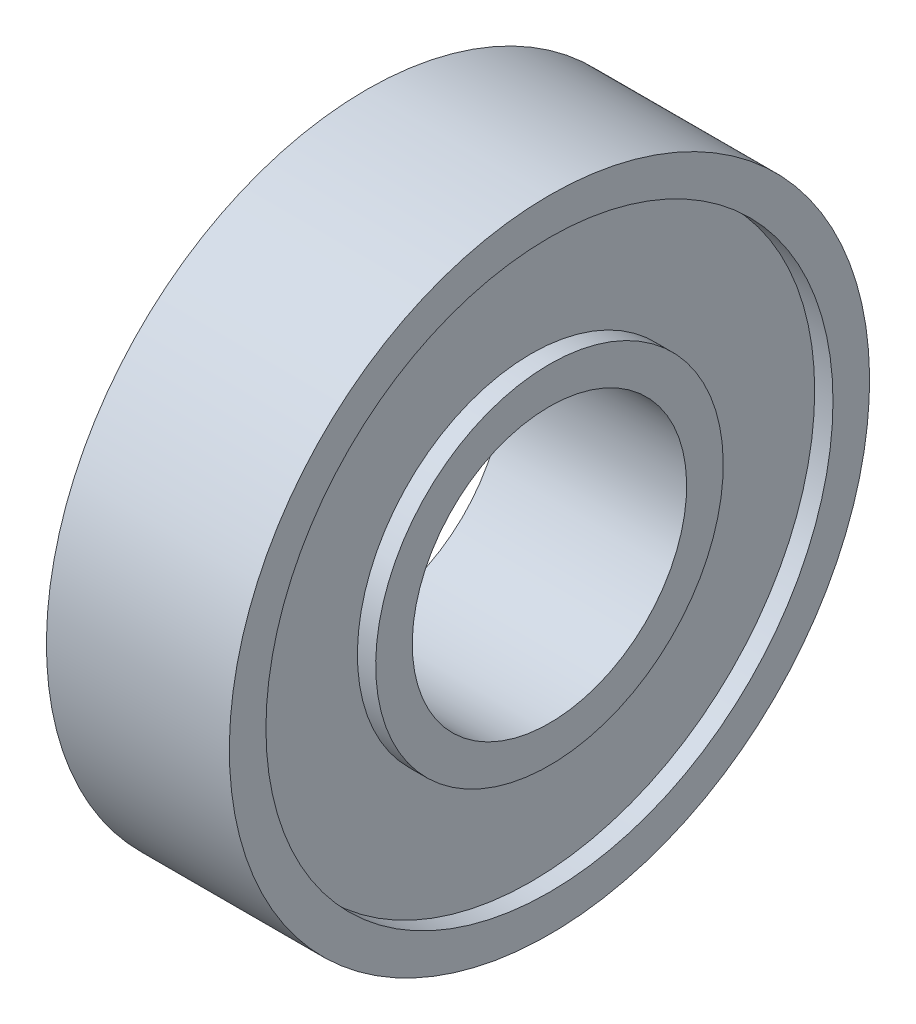
ISO-10303-21;
HEADER;
FILE_DESCRIPTION(('STEP AP214'),'2;1');
FILE_NAME('part.step','',(''),(''),'','','');
FILE_SCHEMA(('AUTOMOTIVE_DESIGN { 1 0 10303 214 1 1 1 1 }'));
ENDSEC;
DATA;
#1=APPLICATION_CONTEXT('core data for automotive mechanical design processes');
#2=APPLICATION_PROTOCOL_DEFINITION('international standard','automotive_design',2000,#1);
#3=PRODUCT_CONTEXT('',#1,'mechanical');
#4=PRODUCT('Part','Part','',(#3));
#5=PRODUCT_RELATED_PRODUCT_CATEGORY('part','',(#4));
#6=PRODUCT_DEFINITION_FORMATION('','',#4);
#7=PRODUCT_DEFINITION_CONTEXT('part definition',#1,'design');
#8=PRODUCT_DEFINITION('design','',#6,#7);
#9=PRODUCT_DEFINITION_SHAPE('','',#8);
#10=(LENGTH_UNIT() NAMED_UNIT(*) SI_UNIT(.MILLI.,.METRE.));
#11=(NAMED_UNIT(*) PLANE_ANGLE_UNIT() SI_UNIT($,.RADIAN.));
#12=(NAMED_UNIT(*) SI_UNIT($,.STERADIAN.) SOLID_ANGLE_UNIT());
#13=UNCERTAINTY_MEASURE_WITH_UNIT(LENGTH_MEASURE(1.E-05),#10,'distance_accuracy_value','');
#14=(GEOMETRIC_REPRESENTATION_CONTEXT(3) GLOBAL_UNCERTAINTY_ASSIGNED_CONTEXT((#13)) GLOBAL_UNIT_ASSIGNED_CONTEXT((#10,
#11,#12)) REPRESENTATION_CONTEXT('',''));
#15=CARTESIAN_POINT('',(0.,0.,0.));
#16=DIRECTION('',(0.,0.,1.));
#17=DIRECTION('',(1.,0.,0.));
#18=AXIS2_PLACEMENT_3D('',#15,#16,#17);
#19=CARTESIAN_POINT('',(-4.,12.4,0.));
#20=DIRECTION('',(-1.,0.,0.));
#21=DIRECTION('',(0.,-1.,0.));
#22=AXIS2_PLACEMENT_3D('',#19,#20,#21);
#23=PLANE('',#22);
#24=CARTESIAN_POINT('',(-4.,0.,0.));
#25=DIRECTION('',(1.,0.,0.));
#26=DIRECTION('',(0.,1.,0.));
#27=AXIS2_PLACEMENT_3D('',#24,#25,#26);
#28=CIRCLE('',#27,12.4);
#29=CARTESIAN_POINT('',(-4.,12.4,0.));
#30=VERTEX_POINT('',#29);
#31=EDGE_CURVE('E10',#30,#30,#28,.T.);
#32=ORIENTED_EDGE('',*,*,#31,.T.);
#33=EDGE_LOOP('',(#32));
#34=FACE_BOUND('',#33,.T.);
#35=CARTESIAN_POINT('',(-4.,0.,0.));
#36=DIRECTION('',(1.,0.,0.));
#37=DIRECTION('',(0.,1.,0.));
#38=AXIS2_PLACEMENT_3D('',#35,#36,#37);
#39=CIRCLE('',#38,14.);
#40=CARTESIAN_POINT('',(-4.,14.,0.));
#41=VERTEX_POINT('',#40);
#42=EDGE_CURVE('E70',#41,#41,#39,.T.);
#43=ORIENTED_EDGE('',*,*,#42,.F.);
#44=EDGE_LOOP('',(#43));
#45=FACE_BOUND('',#44,.T.);
#46=ADVANCED_FACE('F30',(#34,#45),#23,.T.);
#47=CARTESIAN_POINT('',(6.48120818860915,0.,0.));
#48=DIRECTION('',(1.,0.,0.));
#49=DIRECTION('',(0.,1.,0.));
#50=AXIS2_PLACEMENT_3D('',#47,#48,#49);
#51=CYLINDRICAL_SURFACE('',#50,12.4);
#52=CARTESIAN_POINT('',(-3.2,0.,0.));
#53=DIRECTION('',(1.,0.,0.));
#54=DIRECTION('',(0.,1.,0.));
#55=AXIS2_PLACEMENT_3D('',#52,#53,#54);
#56=CIRCLE('',#55,12.4);
#57=CARTESIAN_POINT('',(-3.2,12.4,0.));
#58=VERTEX_POINT('',#57);
#59=EDGE_CURVE('E36',#58,#58,#56,.T.);
#60=ORIENTED_EDGE('',*,*,#59,.T.);
#61=EDGE_LOOP('',(#60));
#62=FACE_BOUND('',#61,.T.);
#63=ORIENTED_EDGE('',*,*,#31,.F.);
#64=EDGE_LOOP('',(#63));
#65=FACE_BOUND('',#64,.T.);
#66=ADVANCED_FACE('F78',(#62,#65),#51,.F.);
#67=CARTESIAN_POINT('',(-3.2,7.6,0.));
#68=DIRECTION('',(-1.,0.,0.));
#69=DIRECTION('',(0.,-1.,0.));
#70=AXIS2_PLACEMENT_3D('',#67,#68,#69);
#71=PLANE('',#70);
#72=CARTESIAN_POINT('',(-3.2,0.,0.));
#73=DIRECTION('',(1.,0.,0.));
#74=DIRECTION('',(0.,1.,0.));
#75=AXIS2_PLACEMENT_3D('',#72,#73,#74);
#76=CIRCLE('',#75,7.6);
#77=CARTESIAN_POINT('',(-3.2,7.6,0.));
#78=VERTEX_POINT('',#77);
#79=EDGE_CURVE('E40',#78,#78,#76,.T.);
#80=ORIENTED_EDGE('',*,*,#79,.T.);
#81=EDGE_LOOP('',(#80));
#82=FACE_BOUND('',#81,.T.);
#83=ORIENTED_EDGE('',*,*,#59,.F.);
#84=EDGE_LOOP('',(#83));
#85=FACE_BOUND('',#84,.T.);
#86=ADVANCED_FACE('F82',(#82,#85),#71,.T.);
#87=CARTESIAN_POINT('',(6.48120818860915,0.,0.));
#88=DIRECTION('',(1.,0.,0.));
#89=DIRECTION('',(0.,1.,0.));
#90=AXIS2_PLACEMENT_3D('',#87,#88,#89);
#91=CYLINDRICAL_SURFACE('',#90,7.6);
#92=CARTESIAN_POINT('',(-4.,0.,0.));
#93=DIRECTION('',(1.,0.,0.));
#94=DIRECTION('',(0.,1.,0.));
#95=AXIS2_PLACEMENT_3D('',#92,#93,#94);
#96=CIRCLE('',#95,7.6);
#97=CARTESIAN_POINT('',(-4.,7.6,0.));
#98=VERTEX_POINT('',#97);
#99=EDGE_CURVE('E44',#98,#98,#96,.T.);
#100=ORIENTED_EDGE('',*,*,#99,.T.);
#101=EDGE_LOOP('',(#100));
#102=FACE_BOUND('',#101,.T.);
#103=ORIENTED_EDGE('',*,*,#79,.F.);
#104=EDGE_LOOP('',(#103));
#105=FACE_BOUND('',#104,.T.);
#106=ADVANCED_FACE('F86',(#102,#105),#91,.T.);
#107=CARTESIAN_POINT('',(-4.,6.,0.));
#108=DIRECTION('',(-1.,0.,0.));
#109=DIRECTION('',(0.,-1.,0.));
#110=AXIS2_PLACEMENT_3D('',#107,#108,#109);
#111=PLANE('',#110);
#112=CARTESIAN_POINT('',(-4.,0.,0.));
#113=DIRECTION('',(1.,0.,0.));
#114=DIRECTION('',(0.,1.,0.));
#115=AXIS2_PLACEMENT_3D('',#112,#113,#114);
#116=CIRCLE('',#115,6.);
#117=CARTESIAN_POINT('',(-4.,6.,0.));
#118=VERTEX_POINT('',#117);
#119=EDGE_CURVE('E49',#118,#118,#116,.T.);
#120=ORIENTED_EDGE('',*,*,#119,.T.);
#121=EDGE_LOOP('',(#120));
#122=FACE_BOUND('',#121,.T.);
#123=ORIENTED_EDGE('',*,*,#99,.F.);
#124=EDGE_LOOP('',(#123));
#125=FACE_BOUND('',#124,.T.);
#126=ADVANCED_FACE('F93',(#122,#125),#111,.T.);
#127=CARTESIAN_POINT('',(6.48120818860915,0.,0.));
#128=DIRECTION('',(1.,0.,0.));
#129=DIRECTION('',(0.,1.,0.));
#130=AXIS2_PLACEMENT_3D('',#127,#128,#129);
#131=CYLINDRICAL_SURFACE('',#130,6.);
#132=CARTESIAN_POINT('',(4.,0.,0.));
#133=DIRECTION('',(1.,0.,0.));
#134=DIRECTION('',(0.,1.,0.));
#135=AXIS2_PLACEMENT_3D('',#132,#133,#134);
#136=CIRCLE('',#135,6.);
#137=CARTESIAN_POINT('',(4.,6.,0.));
#138=VERTEX_POINT('',#137);
#139=EDGE_CURVE('E52',#138,#138,#136,.T.);
#140=ORIENTED_EDGE('',*,*,#139,.T.);
#141=EDGE_LOOP('',(#140));
#142=FACE_BOUND('',#141,.T.);
#143=ORIENTED_EDGE('',*,*,#119,.F.);
#144=EDGE_LOOP('',(#143));
#145=FACE_BOUND('',#144,.T.);
#146=ADVANCED_FACE('F97',(#142,#145),#131,.F.);
#147=CARTESIAN_POINT('',(4.,6.,0.));
#148=DIRECTION('',(1.,0.,0.));
#149=DIRECTION('',(0.,1.,0.));
#150=AXIS2_PLACEMENT_3D('',#147,#148,#149);
#151=PLANE('',#150);
#152=CARTESIAN_POINT('',(4.,0.,0.));
#153=DIRECTION('',(1.,0.,0.));
#154=DIRECTION('',(0.,1.,0.));
#155=AXIS2_PLACEMENT_3D('',#152,#153,#154);
#156=CIRCLE('',#155,7.6);
#157=CARTESIAN_POINT('',(4.,7.6,0.));
#158=VERTEX_POINT('',#157);
#159=EDGE_CURVE('E55',#158,#158,#156,.T.);
#160=ORIENTED_EDGE('',*,*,#159,.T.);
#161=EDGE_LOOP('',(#160));
#162=FACE_BOUND('',#161,.T.);
#163=ORIENTED_EDGE('',*,*,#139,.F.);
#164=EDGE_LOOP('',(#163));
#165=FACE_BOUND('',#164,.T.);
#166=ADVANCED_FACE('F101',(#162,#165),#151,.T.);
#167=CARTESIAN_POINT('',(6.48120818860915,0.,0.));
#168=DIRECTION('',(1.,0.,0.));
#169=DIRECTION('',(0.,1.,0.));
#170=AXIS2_PLACEMENT_3D('',#167,#168,#169);
#171=CYLINDRICAL_SURFACE('',#170,7.6);
#172=CARTESIAN_POINT('',(3.2,0.,0.));
#173=DIRECTION('',(1.,0.,0.));
#174=DIRECTION('',(0.,1.,0.));
#175=AXIS2_PLACEMENT_3D('',#172,#173,#174);
#176=CIRCLE('',#175,7.6);
#177=CARTESIAN_POINT('',(3.2,7.6,0.));
#178=VERTEX_POINT('',#177);
#179=EDGE_CURVE('E58',#178,#178,#176,.T.);
#180=ORIENTED_EDGE('',*,*,#179,.T.);
#181=EDGE_LOOP('',(#180));
#182=FACE_BOUND('',#181,.T.);
#183=ORIENTED_EDGE('',*,*,#159,.F.);
#184=EDGE_LOOP('',(#183));
#185=FACE_BOUND('',#184,.T.);
#186=ADVANCED_FACE('F105',(#182,#185),#171,.T.);
#187=CARTESIAN_POINT('',(3.2,7.6,0.));
#188=DIRECTION('',(1.,0.,0.));
#189=DIRECTION('',(0.,1.,0.));
#190=AXIS2_PLACEMENT_3D('',#187,#188,#189);
#191=PLANE('',#190);
#192=CARTESIAN_POINT('',(3.2,0.,0.));
#193=DIRECTION('',(1.,0.,0.));
#194=DIRECTION('',(0.,1.,0.));
#195=AXIS2_PLACEMENT_3D('',#192,#193,#194);
#196=CIRCLE('',#195,12.4);
#197=CARTESIAN_POINT('',(3.2,12.4,0.));
#198=VERTEX_POINT('',#197);
#199=EDGE_CURVE('E61',#198,#198,#196,.T.);
#200=ORIENTED_EDGE('',*,*,#199,.T.);
#201=EDGE_LOOP('',(#200));
#202=FACE_BOUND('',#201,.T.);
#203=ORIENTED_EDGE('',*,*,#179,.F.);
#204=EDGE_LOOP('',(#203));
#205=FACE_BOUND('',#204,.T.);
#206=ADVANCED_FACE('F109',(#202,#205),#191,.T.);
#207=CARTESIAN_POINT('',(6.48120818860915,0.,0.));
#208=DIRECTION('',(1.,0.,0.));
#209=DIRECTION('',(0.,1.,0.));
#210=AXIS2_PLACEMENT_3D('',#207,#208,#209);
#211=CYLINDRICAL_SURFACE('',#210,12.4);
#212=CARTESIAN_POINT('',(4.,0.,0.));
#213=DIRECTION('',(1.,0.,0.));
#214=DIRECTION('',(0.,1.,0.));
#215=AXIS2_PLACEMENT_3D('',#212,#213,#214);
#216=CIRCLE('',#215,12.4);
#217=CARTESIAN_POINT('',(4.,12.4,0.));
#218=VERTEX_POINT('',#217);
#219=EDGE_CURVE('E64',#218,#218,#216,.T.);
#220=ORIENTED_EDGE('',*,*,#219,.T.);
#221=EDGE_LOOP('',(#220));
#222=FACE_BOUND('',#221,.T.);
#223=ORIENTED_EDGE('',*,*,#199,.F.);
#224=EDGE_LOOP('',(#223));
#225=FACE_BOUND('',#224,.T.);
#226=ADVANCED_FACE('F113',(#222,#225),#211,.F.);
#227=CARTESIAN_POINT('',(4.,12.4,0.));
#228=DIRECTION('',(1.,0.,0.));
#229=DIRECTION('',(0.,1.,0.));
#230=AXIS2_PLACEMENT_3D('',#227,#228,#229);
#231=PLANE('',#230);
#232=CARTESIAN_POINT('',(4.,0.,0.));
#233=DIRECTION('',(1.,0.,0.));
#234=DIRECTION('',(0.,1.,0.));
#235=AXIS2_PLACEMENT_3D('',#232,#233,#234);
#236=CIRCLE('',#235,14.);
#237=CARTESIAN_POINT('',(4.,14.,0.));
#238=VERTEX_POINT('',#237);
#239=EDGE_CURVE('E67',#238,#238,#236,.T.);
#240=ORIENTED_EDGE('',*,*,#239,.T.);
#241=EDGE_LOOP('',(#240));
#242=FACE_BOUND('',#241,.T.);
#243=ORIENTED_EDGE('',*,*,#219,.F.);
#244=EDGE_LOOP('',(#243));
#245=FACE_BOUND('',#244,.T.);
#246=ADVANCED_FACE('F117',(#242,#245),#231,.T.);
#247=CARTESIAN_POINT('',(6.48120818860915,0.,0.));
#248=DIRECTION('',(1.,0.,0.));
#249=DIRECTION('',(0.,1.,0.));
#250=AXIS2_PLACEMENT_3D('',#247,#248,#249);
#251=CYLINDRICAL_SURFACE('',#250,14.);
#252=ORIENTED_EDGE('',*,*,#42,.T.);
#253=EDGE_LOOP('',(#252));
#254=FACE_BOUND('',#253,.T.);
#255=ORIENTED_EDGE('',*,*,#239,.F.);
#256=EDGE_LOOP('',(#255));
#257=FACE_BOUND('',#256,.T.);
#258=ADVANCED_FACE('F74',(#254,#257),#251,.T.);
#259=CLOSED_SHELL('',(#46,#66,#86,#106,#126,#146,#166,#186,#206,#226,#246,#258));
#260=MANIFOLD_SOLID_BREP('B2',#259);
#261=ADVANCED_BREP_SHAPE_REPRESENTATION('',(#18,#260),#14);
#262=SHAPE_DEFINITION_REPRESENTATION(#9,#261);
ENDSEC;
END-ISO-10303-21;
